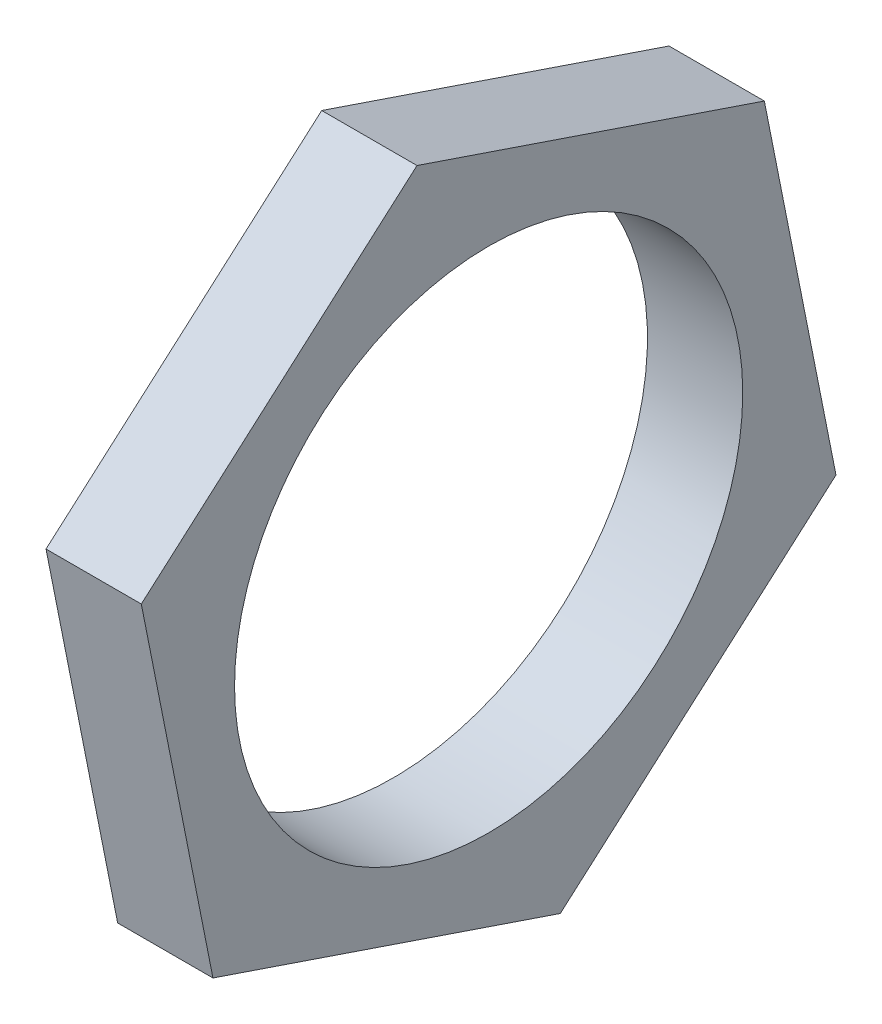
ISO-10303-21;
HEADER;
FILE_DESCRIPTION(('STEP AP214'),'2;1');
FILE_NAME('part.step','',(''),(''),'','','');
FILE_SCHEMA(('AUTOMOTIVE_DESIGN { 1 0 10303 214 1 1 1 1 }'));
ENDSEC;
DATA;
#1=APPLICATION_CONTEXT('core data for automotive mechanical design processes');
#2=APPLICATION_PROTOCOL_DEFINITION('international standard','automotive_design',2000,#1);
#3=PRODUCT_CONTEXT('',#1,'mechanical');
#4=PRODUCT('Part','Part','',(#3));
#5=PRODUCT_RELATED_PRODUCT_CATEGORY('part','',(#4));
#6=PRODUCT_DEFINITION_FORMATION('','',#4);
#7=PRODUCT_DEFINITION_CONTEXT('part definition',#1,'design');
#8=PRODUCT_DEFINITION('design','',#6,#7);
#9=PRODUCT_DEFINITION_SHAPE('','',#8);
#10=(LENGTH_UNIT() NAMED_UNIT(*) SI_UNIT(.MILLI.,.METRE.));
#11=(NAMED_UNIT(*) PLANE_ANGLE_UNIT() SI_UNIT($,.RADIAN.));
#12=(NAMED_UNIT(*) SI_UNIT($,.STERADIAN.) SOLID_ANGLE_UNIT());
#13=UNCERTAINTY_MEASURE_WITH_UNIT(LENGTH_MEASURE(1.E-05),#10,'distance_accuracy_value','');
#14=(GEOMETRIC_REPRESENTATION_CONTEXT(3) GLOBAL_UNCERTAINTY_ASSIGNED_CONTEXT((#13)) GLOBAL_UNIT_ASSIGNED_CONTEXT((#10,
#11,#12)) REPRESENTATION_CONTEXT('',''));
#15=CARTESIAN_POINT('',(0.,0.,0.));
#16=DIRECTION('',(0.,0.,1.));
#17=DIRECTION('',(1.,0.,0.));
#18=AXIS2_PLACEMENT_3D('',#15,#16,#17);
#19=CARTESIAN_POINT('',(3.,-3.7087861650408,-10.9351835153936));
#20=DIRECTION('',(0.,-0.195348373590722,0.980733915460998));
#21=DIRECTION('',(0.,-0.980733915460998,-0.195348373590722));
#22=AXIS2_PLACEMENT_3D('',#19,#20,#21);
#23=PLANE('',#22);
#24=DIRECTION('',(0.,0.980733915460998,0.195348373590722));
#25=VECTOR('',#24,1.);
#26=CARTESIAN_POINT('',(0.,-3.7087861650408,-10.9351835153936));
#27=LINE('',#26,#25);
#28=CARTESIAN_POINT('',(0.,-3.7087861650408,-10.9351835153936));
#29=VERTEX_POINT('',#28);
#30=CARTESIAN_POINT('',(0.,7.61575363685525,-8.67949479382639));
#31=VERTEX_POINT('',#30);
#32=EDGE_CURVE('E117',#29,#31,#27,.T.);
#33=ORIENTED_EDGE('',*,*,#32,.T.);
#34=DIRECTION('',(-1.,0.,0.));
#35=VECTOR('',#34,1.);
#36=CARTESIAN_POINT('',(3.,7.61575363685525,-8.67949479382639));
#37=LINE('',#36,#35);
#38=CARTESIAN_POINT('',(3.,7.61575363685525,-8.67949479382639));
#39=VERTEX_POINT('',#38);
#40=EDGE_CURVE('E11',#39,#31,#37,.T.);
#41=ORIENTED_EDGE('',*,*,#40,.F.);
#42=DIRECTION('',(0.,0.980733915460998,0.195348373590722));
#43=VECTOR('',#42,1.);
#44=CARTESIAN_POINT('',(3.,-3.7087861650408,-10.9351835153936));
#45=LINE('',#44,#43);
#46=CARTESIAN_POINT('',(3.,-3.7087861650408,-10.9351835153936));
#47=VERTEX_POINT('',#46);
#48=EDGE_CURVE('E128',#47,#39,#45,.T.);
#49=ORIENTED_EDGE('',*,*,#48,.F.);
#50=DIRECTION('',(-1.,0.,0.));
#51=VECTOR('',#50,1.);
#52=CARTESIAN_POINT('',(3.,-3.7087861650408,-10.9351835153936));
#53=LINE('',#52,#51);
#54=EDGE_CURVE('E113',#47,#29,#53,.T.);
#55=ORIENTED_EDGE('',*,*,#54,.T.);
#56=EDGE_LOOP('',(#33,#41,#49,#55));
#57=FACE_BOUND('',#56,.T.);
#58=ADVANCED_FACE('F33',(#57),#23,.F.);
#59=CARTESIAN_POINT('',(3.,7.61575363685525,-8.67949479382639));
#60=DIRECTION('',(0.,-0.947014671937565,0.32119030361296));
#61=DIRECTION('',(0.,-0.32119030361296,-0.947014671937565));
#62=AXIS2_PLACEMENT_3D('',#59,#60,#61);
#63=PLANE('',#62);
#64=DIRECTION('',(0.,0.32119030361296,0.947014671937565));
#65=VECTOR('',#64,1.);
#66=CARTESIAN_POINT('',(0.,7.61575363685525,-8.67949479382639));
#67=LINE('',#66,#65);
#68=CARTESIAN_POINT('',(0.,11.3245398018961,2.25568872156718));
#69=VERTEX_POINT('',#68);
#70=EDGE_CURVE('E120',#31,#69,#67,.T.);
#71=ORIENTED_EDGE('',*,*,#70,.T.);
#72=DIRECTION('',(-1.,0.,0.));
#73=VECTOR('',#72,1.);
#74=CARTESIAN_POINT('',(3.,11.3245398018961,2.25568872156718));
#75=LINE('',#74,#73);
#76=CARTESIAN_POINT('',(3.,11.3245398018961,2.25568872156718));
#77=VERTEX_POINT('',#76);
#78=EDGE_CURVE('E41',#77,#69,#75,.T.);
#79=ORIENTED_EDGE('',*,*,#78,.F.);
#80=DIRECTION('',(0.,0.32119030361296,0.947014671937565));
#81=VECTOR('',#80,1.);
#82=CARTESIAN_POINT('',(3.,7.61575363685525,-8.67949479382639));
#83=LINE('',#82,#81);
#84=EDGE_CURVE('E86',#39,#77,#83,.T.);
#85=ORIENTED_EDGE('',*,*,#84,.F.);
#86=ORIENTED_EDGE('',*,*,#40,.T.);
#87=EDGE_LOOP('',(#71,#79,#85,#86));
#88=FACE_BOUND('',#87,.T.);
#89=ADVANCED_FACE('F153',(#88),#63,.F.);
#90=CARTESIAN_POINT('',(3.,11.3245398018961,2.25568872156718));
#91=DIRECTION('',(0.,-0.751666298346843,-0.659543611848038));
#92=DIRECTION('',(0.,0.659543611848038,-0.751666298346843));
#93=AXIS2_PLACEMENT_3D('',#90,#91,#92);
#94=PLANE('',#93);
#95=DIRECTION('',(0.,-0.659543611848038,0.751666298346843));
#96=VECTOR('',#95,1.);
#97=CARTESIAN_POINT('',(0.,11.3245398018961,2.25568872156718));
#98=LINE('',#97,#96);
#99=CARTESIAN_POINT('',(0.,3.7087861650408,10.9351835153936));
#100=VERTEX_POINT('',#99);
#101=EDGE_CURVE('E123',#69,#100,#98,.T.);
#102=ORIENTED_EDGE('',*,*,#101,.T.);
#103=DIRECTION('',(-1.,0.,0.));
#104=VECTOR('',#103,1.);
#105=CARTESIAN_POINT('',(3.,3.7087861650408,10.9351835153936));
#106=LINE('',#105,#104);
#107=CARTESIAN_POINT('',(3.,3.7087861650408,10.9351835153936));
#108=VERTEX_POINT('',#107);
#109=EDGE_CURVE('E108',#108,#100,#106,.T.);
#110=ORIENTED_EDGE('',*,*,#109,.F.);
#111=DIRECTION('',(0.,-0.659543611848038,0.751666298346843));
#112=VECTOR('',#111,1.);
#113=CARTESIAN_POINT('',(3.,11.3245398018961,2.25568872156718));
#114=LINE('',#113,#112);
#115=EDGE_CURVE('E99',#77,#108,#114,.T.);
#116=ORIENTED_EDGE('',*,*,#115,.F.);
#117=ORIENTED_EDGE('',*,*,#78,.T.);
#118=EDGE_LOOP('',(#102,#110,#116,#117));
#119=FACE_BOUND('',#118,.T.);
#120=ADVANCED_FACE('F134',(#119),#94,.F.);
#121=CARTESIAN_POINT('',(3.,3.7087861650408,10.9351835153936));
#122=DIRECTION('',(0.,0.195348373590722,-0.980733915460998));
#123=DIRECTION('',(0.,0.980733915460998,0.195348373590722));
#124=AXIS2_PLACEMENT_3D('',#121,#122,#123);
#125=PLANE('',#124);
#126=DIRECTION('',(0.,-0.980733915460998,-0.195348373590722));
#127=VECTOR('',#126,1.);
#128=CARTESIAN_POINT('',(0.,3.7087861650408,10.9351835153936));
#129=LINE('',#128,#127);
#130=CARTESIAN_POINT('',(0.,-7.61575363685525,8.67949479382639));
#131=VERTEX_POINT('',#130);
#132=EDGE_CURVE('E107',#100,#131,#129,.T.);
#133=ORIENTED_EDGE('',*,*,#132,.T.);
#134=DIRECTION('',(-1.,0.,0.));
#135=VECTOR('',#134,1.);
#136=CARTESIAN_POINT('',(3.,-7.61575363685525,8.67949479382639));
#137=LINE('',#136,#135);
#138=CARTESIAN_POINT('',(3.,-7.61575363685525,8.67949479382639));
#139=VERTEX_POINT('',#138);
#140=EDGE_CURVE('E104',#139,#131,#137,.T.);
#141=ORIENTED_EDGE('',*,*,#140,.F.);
#142=DIRECTION('',(0.,-0.980733915460998,-0.195348373590722));
#143=VECTOR('',#142,1.);
#144=CARTESIAN_POINT('',(3.,3.7087861650408,10.9351835153936));
#145=LINE('',#144,#143);
#146=EDGE_CURVE('E93',#108,#139,#145,.T.);
#147=ORIENTED_EDGE('',*,*,#146,.F.);
#148=ORIENTED_EDGE('',*,*,#109,.T.);
#149=EDGE_LOOP('',(#133,#141,#147,#148));
#150=FACE_BOUND('',#149,.T.);
#151=ADVANCED_FACE('F105',(#150),#125,.F.);
#152=CARTESIAN_POINT('',(3.,-7.61575363685525,8.67949479382639));
#153=DIRECTION('',(0.,0.947014671937565,-0.32119030361296));
#154=DIRECTION('',(0.,0.32119030361296,0.947014671937565));
#155=AXIS2_PLACEMENT_3D('',#152,#153,#154);
#156=PLANE('',#155);
#157=DIRECTION('',(0.,-0.32119030361296,-0.947014671937565));
#158=VECTOR('',#157,1.);
#159=CARTESIAN_POINT('',(0.,-7.61575363685525,8.67949479382639));
#160=LINE('',#159,#158);
#161=CARTESIAN_POINT('',(0.,-11.3245398018961,-2.25568872156718));
#162=VERTEX_POINT('',#161);
#163=EDGE_CURVE('E72',#131,#162,#160,.T.);
#164=ORIENTED_EDGE('',*,*,#163,.T.);
#165=DIRECTION('',(-1.,0.,0.));
#166=VECTOR('',#165,1.);
#167=CARTESIAN_POINT('',(3.,-11.3245398018961,-2.25568872156718));
#168=LINE('',#167,#166);
#169=CARTESIAN_POINT('',(3.,-11.3245398018961,-2.25568872156718));
#170=VERTEX_POINT('',#169);
#171=EDGE_CURVE('E109',#170,#162,#168,.T.);
#172=ORIENTED_EDGE('',*,*,#171,.F.);
#173=DIRECTION('',(0.,-0.32119030361296,-0.947014671937565));
#174=VECTOR('',#173,1.);
#175=CARTESIAN_POINT('',(3.,-7.61575363685525,8.67949479382639));
#176=LINE('',#175,#174);
#177=EDGE_CURVE('E97',#139,#170,#176,.T.);
#178=ORIENTED_EDGE('',*,*,#177,.F.);
#179=ORIENTED_EDGE('',*,*,#140,.T.);
#180=EDGE_LOOP('',(#164,#172,#178,#179));
#181=FACE_BOUND('',#180,.T.);
#182=ADVANCED_FACE('F111',(#181),#156,.F.);
#183=CARTESIAN_POINT('',(3.,-11.3245398018961,-2.25568872156718));
#184=DIRECTION('',(0.,0.751666298346843,0.659543611848038));
#185=DIRECTION('',(0.,-0.659543611848038,0.751666298346843));
#186=AXIS2_PLACEMENT_3D('',#183,#184,#185);
#187=PLANE('',#186);
#188=DIRECTION('',(0.,0.659543611848038,-0.751666298346843));
#189=VECTOR('',#188,1.);
#190=CARTESIAN_POINT('',(0.,-11.3245398018961,-2.25568872156718));
#191=LINE('',#190,#189);
#192=EDGE_CURVE('E78',#162,#29,#191,.T.);
#193=ORIENTED_EDGE('',*,*,#192,.T.);
#194=ORIENTED_EDGE('',*,*,#54,.F.);
#195=DIRECTION('',(0.,0.659543611848038,-0.751666298346843));
#196=VECTOR('',#195,1.);
#197=CARTESIAN_POINT('',(3.,-11.3245398018961,-2.25568872156718));
#198=LINE('',#197,#196);
#199=EDGE_CURVE('E49',#170,#47,#198,.T.);
#200=ORIENTED_EDGE('',*,*,#199,.F.);
#201=ORIENTED_EDGE('',*,*,#171,.T.);
#202=EDGE_LOOP('',(#193,#194,#200,#201));
#203=FACE_BOUND('',#202,.T.);
#204=ADVANCED_FACE('F141',(#203),#187,.F.);
#205=CARTESIAN_POINT('',(3.,7.61575363685525,-8.67949479382639));
#206=DIRECTION('',(1.,0.,0.));
#207=DIRECTION('',(0.,0.,-1.));
#208=AXIS2_PLACEMENT_3D('',#205,#206,#207);
#209=PLANE('',#208);
#210=CARTESIAN_POINT('',(3.,0.,0.));
#211=DIRECTION('',(1.,0.,0.));
#212=DIRECTION('',(0.,0.,-1.));
#213=AXIS2_PLACEMENT_3D('',#210,#211,#212);
#214=CIRCLE('',#213,8.);
#215=CARTESIAN_POINT('',(3.,0.,-8.));
#216=VERTEX_POINT('',#215);
#217=EDGE_CURVE('E206',#216,#216,#214,.F.);
#218=ORIENTED_EDGE('',*,*,#217,.T.);
#219=EDGE_LOOP('',(#218));
#220=FACE_BOUND('',#219,.T.);
#221=ORIENTED_EDGE('',*,*,#48,.T.);
#222=ORIENTED_EDGE('',*,*,#84,.T.);
#223=ORIENTED_EDGE('',*,*,#115,.T.);
#224=ORIENTED_EDGE('',*,*,#146,.T.);
#225=ORIENTED_EDGE('',*,*,#177,.T.);
#226=ORIENTED_EDGE('',*,*,#199,.T.);
#227=EDGE_LOOP('',(#221,#222,#223,#224,#225,#226));
#228=FACE_BOUND('',#227,.T.);
#229=ADVANCED_FACE('F95',(#220,#228),#209,.T.);
#230=CARTESIAN_POINT('',(0.,7.61575363685525,-8.67949479382639));
#231=DIRECTION('',(1.,0.,0.));
#232=DIRECTION('',(0.,0.,-1.));
#233=AXIS2_PLACEMENT_3D('',#230,#231,#232);
#234=PLANE('',#233);
#235=CARTESIAN_POINT('',(0.,0.,0.));
#236=DIRECTION('',(-1.,0.,0.));
#237=DIRECTION('',(0.,0.,1.));
#238=AXIS2_PLACEMENT_3D('',#235,#236,#237);
#239=CIRCLE('',#238,8.);
#240=CARTESIAN_POINT('',(0.,0.,8.));
#241=VERTEX_POINT('',#240);
#242=EDGE_CURVE('E121',#241,#241,#239,.T.);
#243=ORIENTED_EDGE('',*,*,#242,.F.);
#244=EDGE_LOOP('',(#243));
#245=FACE_BOUND('',#244,.T.);
#246=ORIENTED_EDGE('',*,*,#32,.F.);
#247=ORIENTED_EDGE('',*,*,#192,.F.);
#248=ORIENTED_EDGE('',*,*,#163,.F.);
#249=ORIENTED_EDGE('',*,*,#132,.F.);
#250=ORIENTED_EDGE('',*,*,#101,.F.);
#251=ORIENTED_EDGE('',*,*,#70,.F.);
#252=EDGE_LOOP('',(#246,#247,#248,#249,#250,#251));
#253=FACE_BOUND('',#252,.T.);
#254=ADVANCED_FACE('F137',(#245,#253),#234,.F.);
#255=CARTESIAN_POINT('',(3.001,0.,0.));
#256=DIRECTION('',(-1.,0.,0.));
#257=DIRECTION('',(0.,0.,1.));
#258=AXIS2_PLACEMENT_3D('',#255,#256,#257);
#259=CYLINDRICAL_SURFACE('',#258,8.);
#260=ORIENTED_EDGE('',*,*,#217,.F.);
#261=EDGE_LOOP('',(#260));
#262=FACE_BOUND('',#261,.T.);
#263=ORIENTED_EDGE('',*,*,#242,.T.);
#264=EDGE_LOOP('',(#263));
#265=FACE_BOUND('',#264,.T.);
#266=ADVANCED_FACE('F190',(#262,#265),#259,.F.);
#267=CLOSED_SHELL('',(#58,#89,#120,#151,#182,#204,#229,#254,#266));
#268=MANIFOLD_SOLID_BREP('B2',#267);
#269=ADVANCED_BREP_SHAPE_REPRESENTATION('',(#18,#268),#14);
#270=SHAPE_DEFINITION_REPRESENTATION(#9,#269);
ENDSEC;
END-ISO-10303-21;
